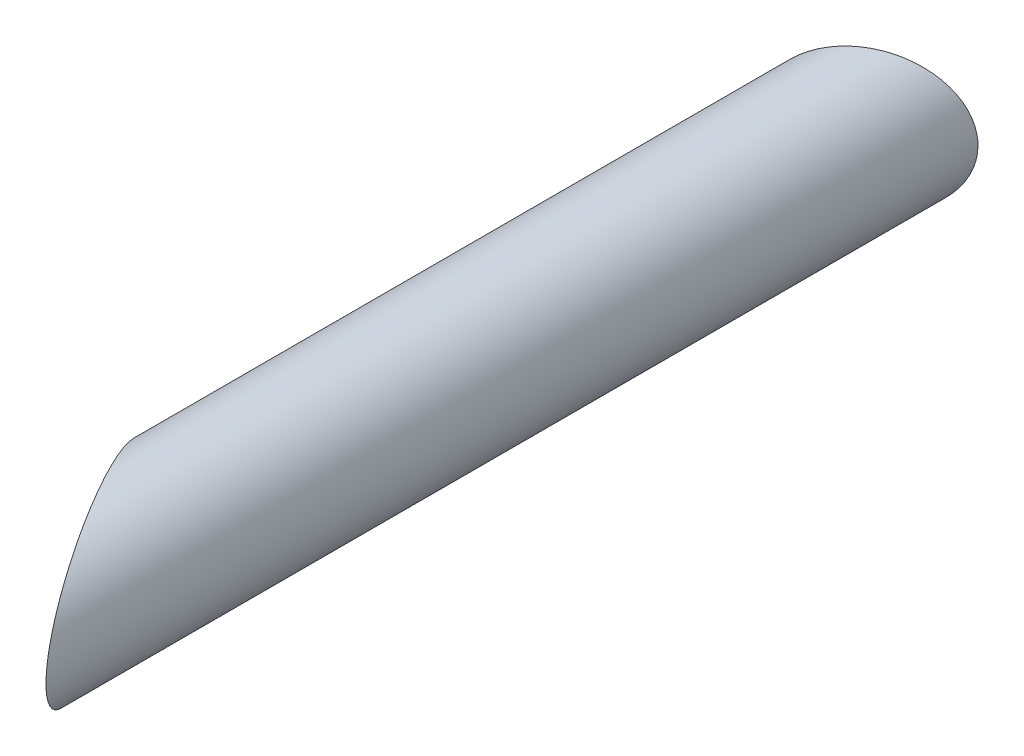
ISO-10303-21;
HEADER;
FILE_DESCRIPTION(('STEP AP214'),'2;1');
FILE_NAME('part.step','',(''),(''),'','','');
FILE_SCHEMA(('AUTOMOTIVE_DESIGN { 1 0 10303 214 1 1 1 1 }'));
ENDSEC;
DATA;
#1=APPLICATION_CONTEXT('core data for automotive mechanical design processes');
#2=APPLICATION_PROTOCOL_DEFINITION('international standard','automotive_design',2000,#1);
#3=PRODUCT_CONTEXT('',#1,'mechanical');
#4=PRODUCT('Part','Part','',(#3));
#5=PRODUCT_RELATED_PRODUCT_CATEGORY('part','',(#4));
#6=PRODUCT_DEFINITION_FORMATION('','',#4);
#7=PRODUCT_DEFINITION_CONTEXT('part definition',#1,'design');
#8=PRODUCT_DEFINITION('design','',#6,#7);
#9=PRODUCT_DEFINITION_SHAPE('','',#8);
#10=(LENGTH_UNIT() NAMED_UNIT(*) SI_UNIT(.MILLI.,.METRE.));
#11=(NAMED_UNIT(*) PLANE_ANGLE_UNIT() SI_UNIT($,.RADIAN.));
#12=(NAMED_UNIT(*) SI_UNIT($,.STERADIAN.) SOLID_ANGLE_UNIT());
#13=UNCERTAINTY_MEASURE_WITH_UNIT(LENGTH_MEASURE(1.E-05),#10,'distance_accuracy_value','');
#14=(GEOMETRIC_REPRESENTATION_CONTEXT(3) GLOBAL_UNCERTAINTY_ASSIGNED_CONTEXT((#13)) GLOBAL_UNIT_ASSIGNED_CONTEXT((#10,
#11,#12)) REPRESENTATION_CONTEXT('',''));
#15=CARTESIAN_POINT('',(0.,0.,0.));
#16=DIRECTION('',(0.,0.,1.));
#17=DIRECTION('',(1.,0.,0.));
#18=AXIS2_PLACEMENT_3D('',#15,#16,#17);
#19=CARTESIAN_POINT('',(0.,0.,100.));
#20=DIRECTION('',(0.,0.,-1.));
#21=DIRECTION('',(-1.,0.,0.));
#22=AXIS2_PLACEMENT_3D('',#19,#20,#21);
#23=CYLINDRICAL_SURFACE('',#22,7.5);
#24=CARTESIAN_POINT('',(0.,0.,87.0096189432336));
#25=DIRECTION('',(-0.866025403784436,0.,0.500000000000005));
#26=DIRECTION('',(-0.500000000000005,0.,-0.866025403784436));
#27=AXIS2_PLACEMENT_3D('',#24,#25,#26);
#28=ELLIPSE('',#27,14.9999999999999,7.5);
#29=CARTESIAN_POINT('',(-7.5,0.,74.0192378864671));
#30=VERTEX_POINT('',#29);
#31=EDGE_CURVE('E11',#30,#30,#28,.T.);
#32=ORIENTED_EDGE('',*,*,#31,.F.);
#33=EDGE_LOOP('',(#32));
#34=FACE_BOUND('',#33,.T.);
#35=CARTESIAN_POINT('',(0.,0.,4.3301270189222));
#36=DIRECTION('',(-0.500000000000001,0.,-0.866025403784438));
#37=DIRECTION('',(0.866025403784438,0.,-0.500000000000001));
#38=AXIS2_PLACEMENT_3D('',#35,#36,#37);
#39=ELLIPSE('',#38,8.66025403784439,7.5);
#40=CARTESIAN_POINT('',(7.5,0.,0.));
#41=VERTEX_POINT('',#40);
#42=EDGE_CURVE('E58',#41,#41,#39,.T.);
#43=ORIENTED_EDGE('',*,*,#42,.F.);
#44=EDGE_LOOP('',(#43));
#45=FACE_BOUND('',#44,.T.);
#46=ADVANCED_FACE('F50',(#34,#45),#23,.T.);
#47=CARTESIAN_POINT('',(-4.92211659768965,7.5,78.4842629152571));
#48=DIRECTION('',(-0.866025403784436,0.,0.500000000000005));
#49=DIRECTION('',(0.500000000000005,0.,0.866025403784436));
#50=AXIS2_PLACEMENT_3D('',#47,#48,#49);
#51=PLANE('',#50);
#52=CARTESIAN_POINT('',(-3.49999999999997,0.,80.9474411167427));
#53=DIRECTION('',(-0.866025403784436,0.,0.500000000000005));
#54=DIRECTION('',(0.500000000000005,0.,0.866025403784436));
#55=AXIS2_PLACEMENT_3D('',#52,#53,#54);
#56=CIRCLE('',#55,2.09999999999999);
#57=CARTESIAN_POINT('',(-2.44999999999996,0.,82.76609446469));
#58=VERTEX_POINT('',#57);
#59=EDGE_CURVE('E76',#58,#58,#56,.T.);
#60=ORIENTED_EDGE('',*,*,#59,.F.);
#61=EDGE_LOOP('',(#60));
#62=FACE_BOUND('',#61,.T.);
#63=ORIENTED_EDGE('',*,*,#31,.T.);
#64=EDGE_LOOP('',(#63));
#65=FACE_BOUND('',#64,.T.);
#66=ADVANCED_FACE('F95',(#62,#65),#51,.T.);
#67=CARTESIAN_POINT('',(7.5,7.5,0.));
#68=DIRECTION('',(-0.500000000000001,0.,-0.866025403784438));
#69=DIRECTION('',(-0.866025403784438,0.,0.500000000000001));
#70=AXIS2_PLACEMENT_3D('',#67,#68,#69);
#71=PLANE('',#70);
#72=CARTESIAN_POINT('',(-2.30384757729337,0.,5.66025403784441));
#73=DIRECTION('',(-0.500000000000001,0.,-0.866025403784438));
#74=DIRECTION('',(-0.866025403784438,0.,0.500000000000001));
#75=AXIS2_PLACEMENT_3D('',#72,#73,#74);
#76=CIRCLE('',#75,2.09999999999999);
#77=CARTESIAN_POINT('',(-4.12250092524068,0.,6.7102540378444));
#78=VERTEX_POINT('',#77);
#79=EDGE_CURVE('E75',#78,#78,#76,.T.);
#80=ORIENTED_EDGE('',*,*,#79,.F.);
#81=EDGE_LOOP('',(#80));
#82=FACE_BOUND('',#81,.T.);
#83=ORIENTED_EDGE('',*,*,#42,.T.);
#84=EDGE_LOOP('',(#83));
#85=FACE_BOUND('',#84,.T.);
#86=ADVANCED_FACE('F92',(#82,#85),#71,.T.);
#87=CARTESIAN_POINT('',(2.69615242270664,0.,14.3205080756888));
#88=DIRECTION('',(-0.500000000000001,0.,-0.866025403784438));
#89=DIRECTION('',(-0.866025403784438,0.,0.500000000000001));
#90=AXIS2_PLACEMENT_3D('',#87,#88,#89);
#91=CONICAL_SURFACE('',#90,2.1,1.02974425867665);
#92=CARTESIAN_POINT('',(3.32705607268558,0.,15.413265252133));
#93=VERTEX_POINT('',#92);
#94=VERTEX_LOOP('',#93);
#95=FACE_BOUND('',#94,.T.);
#96=CARTESIAN_POINT('',(2.69615242270664,0.,14.3205080756888));
#97=DIRECTION('',(-0.500000000000001,0.,-0.866025403784438));
#98=DIRECTION('',(-0.866025403784438,0.,0.500000000000001));
#99=AXIS2_PLACEMENT_3D('',#96,#97,#98);
#100=CIRCLE('',#99,2.1);
#101=CARTESIAN_POINT('',(0.877499074759327,0.,15.3705080756888));
#102=VERTEX_POINT('',#101);
#103=EDGE_CURVE('E81',#102,#102,#100,.T.);
#104=ORIENTED_EDGE('',*,*,#103,.T.);
#105=EDGE_LOOP('',(#104));
#106=FACE_BOUND('',#105,.T.);
#107=ADVANCED_FACE('F106',(#95,#106),#91,.F.);
#108=CARTESIAN_POINT('',(-2.30384757729337,0.,5.66025403784441));
#109=DIRECTION('',(-0.500000000000001,0.,-0.866025403784438));
#110=DIRECTION('',(-0.866025403784438,0.,0.500000000000001));
#111=AXIS2_PLACEMENT_3D('',#108,#109,#110);
#112=CYLINDRICAL_SURFACE('',#111,2.09999999999999);
#113=ORIENTED_EDGE('',*,*,#103,.F.);
#114=EDGE_LOOP('',(#113));
#115=FACE_BOUND('',#114,.T.);
#116=ORIENTED_EDGE('',*,*,#79,.T.);
#117=EDGE_LOOP('',(#116));
#118=FACE_BOUND('',#117,.T.);
#119=ADVANCED_FACE('F68',(#115,#118),#112,.F.);
#120=CARTESIAN_POINT('',(2.56217782649108,0.,77.4474411167426));
#121=DIRECTION('',(-0.866025403784436,0.,0.500000000000005));
#122=DIRECTION('',(0.500000000000005,0.,0.866025403784436));
#123=AXIS2_PLACEMENT_3D('',#120,#121,#122);
#124=CONICAL_SURFACE('',#123,2.1,1.02974425867665);
#125=CARTESIAN_POINT('',(3.65493500293525,0.,76.8165374667637));
#126=VERTEX_POINT('',#125);
#127=VERTEX_LOOP('',#126);
#128=FACE_BOUND('',#127,.T.);
#129=CARTESIAN_POINT('',(2.56217782649108,0.,77.4474411167426));
#130=DIRECTION('',(-0.866025403784436,0.,0.500000000000005));
#131=DIRECTION('',(0.500000000000005,0.,0.866025403784436));
#132=AXIS2_PLACEMENT_3D('',#129,#130,#131);
#133=CIRCLE('',#132,2.1);
#134=CARTESIAN_POINT('',(3.61217782649109,0.,79.2660944646899));
#135=VERTEX_POINT('',#134);
#136=EDGE_CURVE('E72',#135,#135,#133,.T.);
#137=ORIENTED_EDGE('',*,*,#136,.T.);
#138=EDGE_LOOP('',(#137));
#139=FACE_BOUND('',#138,.T.);
#140=ADVANCED_FACE('F64',(#128,#139),#124,.F.);
#141=CARTESIAN_POINT('',(-3.49999999999997,0.,80.9474411167427));
#142=DIRECTION('',(-0.866025403784436,0.,0.500000000000005));
#143=DIRECTION('',(0.500000000000005,0.,0.866025403784436));
#144=AXIS2_PLACEMENT_3D('',#141,#142,#143);
#145=CYLINDRICAL_SURFACE('',#144,2.09999999999999);
#146=ORIENTED_EDGE('',*,*,#136,.F.);
#147=EDGE_LOOP('',(#146));
#148=FACE_BOUND('',#147,.T.);
#149=ORIENTED_EDGE('',*,*,#59,.T.);
#150=EDGE_LOOP('',(#149));
#151=FACE_BOUND('',#150,.T.);
#152=ADVANCED_FACE('F67',(#148,#151),#145,.F.);
#153=CLOSED_SHELL('',(#46,#66,#86,#107,#119,#140,#152));
#154=MANIFOLD_SOLID_BREP('B2',#153);
#155=ADVANCED_BREP_SHAPE_REPRESENTATION('',(#18,#154),#14);
#156=SHAPE_DEFINITION_REPRESENTATION(#9,#155);
ENDSEC;
END-ISO-10303-21;
